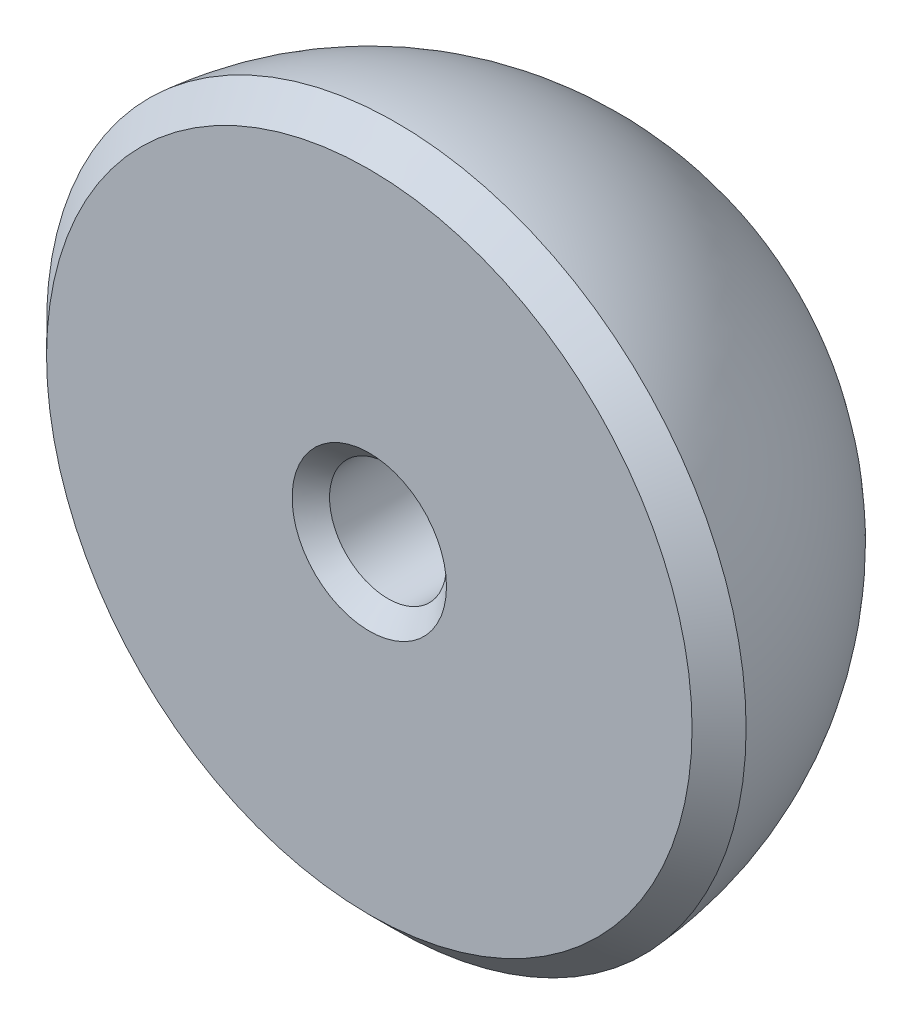
ISO-10303-21;
HEADER;
FILE_DESCRIPTION(('STEP AP214'),'2;1');
FILE_NAME('part.step','',(''),(''),'','','');
FILE_SCHEMA(('AUTOMOTIVE_DESIGN { 1 0 10303 214 1 1 1 1 }'));
ENDSEC;
DATA;
#1=APPLICATION_CONTEXT('core data for automotive mechanical design processes');
#2=APPLICATION_PROTOCOL_DEFINITION('international standard','automotive_design',2000,#1);
#3=PRODUCT_CONTEXT('',#1,'mechanical');
#4=PRODUCT('Part','Part','',(#3));
#5=PRODUCT_RELATED_PRODUCT_CATEGORY('part','',(#4));
#6=PRODUCT_DEFINITION_FORMATION('','',#4);
#7=PRODUCT_DEFINITION_CONTEXT('part definition',#1,'design');
#8=PRODUCT_DEFINITION('design','',#6,#7);
#9=PRODUCT_DEFINITION_SHAPE('','',#8);
#10=(LENGTH_UNIT() NAMED_UNIT(*) SI_UNIT(.MILLI.,.METRE.));
#11=(NAMED_UNIT(*) PLANE_ANGLE_UNIT() SI_UNIT($,.RADIAN.));
#12=(NAMED_UNIT(*) SI_UNIT($,.STERADIAN.) SOLID_ANGLE_UNIT());
#13=UNCERTAINTY_MEASURE_WITH_UNIT(LENGTH_MEASURE(1.E-05),#10,'distance_accuracy_value','');
#14=(GEOMETRIC_REPRESENTATION_CONTEXT(3) GLOBAL_UNCERTAINTY_ASSIGNED_CONTEXT((#13)) GLOBAL_UNIT_ASSIGNED_CONTEXT((#10,
#11,#12)) REPRESENTATION_CONTEXT('',''));
#15=CARTESIAN_POINT('',(0.,0.,0.));
#16=DIRECTION('',(0.,0.,1.));
#17=DIRECTION('',(1.,0.,0.));
#18=AXIS2_PLACEMENT_3D('',#15,#16,#17);
#19=CARTESIAN_POINT('',(0.,0.,0.));
#20=DIRECTION('',(0.,0.,1.));
#21=DIRECTION('',(1.,0.,0.));
#22=AXIS2_PLACEMENT_3D('',#19,#20,#21);
#23=CYLINDRICAL_SURFACE('',#22,1.5875);
#24=CARTESIAN_POINT('',(0.,0.,-2.67384938789308));
#25=DIRECTION('',(0.,0.,1.));
#26=DIRECTION('',(1.,0.,0.));
#27=AXIS2_PLACEMENT_3D('',#24,#25,#26);
#28=CIRCLE('',#27,1.5875);
#29=CARTESIAN_POINT('',(1.5875,0.,-2.67384938789308));
#30=VERTEX_POINT('',#29);
#31=EDGE_CURVE('E53',#30,#30,#28,.F.);
#32=ORIENTED_EDGE('',*,*,#31,.T.);
#33=EDGE_LOOP('',(#32));
#34=FACE_BOUND('',#33,.T.);
#35=CARTESIAN_POINT('',(0.,0.,-0.508000000000002));
#36=DIRECTION('',(0.,0.,1.));
#37=DIRECTION('',(1.,0.,0.));
#38=AXIS2_PLACEMENT_3D('',#35,#36,#37);
#39=CIRCLE('',#38,1.5875);
#40=CARTESIAN_POINT('',(1.5875,0.,-0.508000000000002));
#41=VERTEX_POINT('',#40);
#42=EDGE_CURVE('E56',#41,#41,#39,.T.);
#43=ORIENTED_EDGE('',*,*,#42,.T.);
#44=EDGE_LOOP('',(#43));
#45=FACE_BOUND('',#44,.T.);
#46=ADVANCED_FACE('F32',(#34,#45),#23,.F.);
#47=CARTESIAN_POINT('',(1.5875,0.,0.));
#48=DIRECTION('',(0.,0.,1.));
#49=DIRECTION('',(1.,0.,0.));
#50=AXIS2_PLACEMENT_3D('',#47,#48,#49);
#51=PLANE('',#50);
#52=CARTESIAN_POINT('',(0.,0.,0.));
#53=DIRECTION('',(0.,0.,1.));
#54=DIRECTION('',(1.,0.,0.));
#55=AXIS2_PLACEMENT_3D('',#52,#53,#54);
#56=CIRCLE('',#55,2.0955);
#57=CARTESIAN_POINT('',(2.0955,0.,0.));
#58=VERTEX_POINT('',#57);
#59=EDGE_CURVE('E44',#58,#58,#56,.F.);
#60=ORIENTED_EDGE('',*,*,#59,.T.);
#61=EDGE_LOOP('',(#60));
#62=FACE_BOUND('',#61,.T.);
#63=CARTESIAN_POINT('',(0.,0.,0.));
#64=DIRECTION('',(0.,0.,1.));
#65=DIRECTION('',(1.,0.,0.));
#66=AXIS2_PLACEMENT_3D('',#63,#64,#65);
#67=CIRCLE('',#66,8.76300000000001);
#68=CARTESIAN_POINT('',(8.76300000000001,0.,0.));
#69=VERTEX_POINT('',#68);
#70=EDGE_CURVE('E62',#69,#69,#67,.T.);
#71=ORIENTED_EDGE('',*,*,#70,.T.);
#72=EDGE_LOOP('',(#71));
#73=FACE_BOUND('',#72,.T.);
#74=ADVANCED_FACE('F87',(#62,#73),#51,.T.);
#75=CARTESIAN_POINT('',(0.,0.,0.));
#76=DIRECTION('',(0.,0.,1.));
#77=DIRECTION('',(1.,0.,0.));
#78=AXIS2_PLACEMENT_3D('',#75,#76,#77);
#79=SPHERICAL_SURFACE('',#78,9.525);
#80=CARTESIAN_POINT('',(0.,0.,-9.08629253509194));
#81=DIRECTION('',(0.,0.,1.));
#82=DIRECTION('',(1.,0.,0.));
#83=AXIS2_PLACEMENT_3D('',#80,#81,#82);
#84=CIRCLE('',#83,2.85743118320155);
#85=CARTESIAN_POINT('',(2.85743118320154,0.,-9.08629253509194));
#86=VERTEX_POINT('',#85);
#87=EDGE_CURVE('E10',#86,#86,#84,.T.);
#88=CARTESIAN_POINT('',(0.,0.,-0.733699922779166));
#89=DIRECTION('',(0.,0.,1.));
#90=DIRECTION('',(1.,0.,0.));
#91=AXIS2_PLACEMENT_3D('',#88,#89,#90);
#92=CIRCLE('',#91,9.49669992277917);
#93=CARTESIAN_POINT('',(9.49669992277917,0.,-0.733699922779166));
#94=VERTEX_POINT('',#93);
#95=EDGE_CURVE('E59',#94,#94,#92,.F.);
#96=CARTESIAN_POINT('',(2.85743118320154,0.,-9.08629253509194));
#97=CARTESIAN_POINT('',(2.96996963361237,0.,-9.05090290470426));
#98=CARTESIAN_POINT('',(3.08184988212297,0.,-9.01342050333686));
#99=CARTESIAN_POINT('',(3.30414113074718,0.,-8.93432639658185));
#100=CARTESIAN_POINT('',(3.41455213086079,0.,-8.89271469119425));
#101=CARTESIAN_POINT('',(3.63375203809447,0.,-8.80541821433812));
#102=CARTESIAN_POINT('',(3.74254094521454,0.,-8.75973344286959));
#103=CARTESIAN_POINT('',(3.95834660452778,0.,-8.66435422180381));
#104=CARTESIAN_POINT('',(4.06536335672094,0.,-8.61465977220656));
#105=CARTESIAN_POINT('',(4.27747694498504,0.,-8.51132970870316));
#106=CARTESIAN_POINT('',(4.38257378105598,0.,-8.45769409479702));
#107=CARTESIAN_POINT('',(4.59070246523173,0.,-8.34655576670554));
#108=CARTESIAN_POINT('',(4.69373431333655,0.,-8.28905305252021));
#109=CARTESIAN_POINT('',(4.89759078987735,0.,-8.17025989682426));
#110=CARTESIAN_POINT('',(4.99841541831334,0.,-8.10896945531364));
#111=CARTESIAN_POINT('',(5.197718273554,0.,-7.98268545453226));
#112=CARTESIAN_POINT('',(5.29619650035867,0.,-7.91769189526151));
#113=CARTESIAN_POINT('',(5.49067060869496,0.,-7.7840913783548));
#114=CARTESIAN_POINT('',(5.58666649022659,0.,-7.71548442071884));
#115=CARTESIAN_POINT('',(5.77604339130998,0.,-7.57475181512889));
#116=CARTESIAN_POINT('',(5.86942441086173,0.,-7.50262616717489));
#117=CARTESIAN_POINT('',(6.05344268089001,0.,-7.35495574619255));
#118=CARTESIAN_POINT('',(6.14407993136653,0.,-7.27941097316421));
#119=CARTESIAN_POINT('',(6.32248554377757,0.,-7.1250065872214));
#120=CARTESIAN_POINT('',(6.41025390571209,0.,-7.04614697430693));
#121=CARTESIAN_POINT('',(6.5828005819028,0.,-6.88522176971354));
#122=CARTESIAN_POINT('',(6.66757889615899,0.,-6.8031561780346));
#123=CARTESIAN_POINT('',(6.83402844544524,0.,-6.63593230270466));
#124=CARTESIAN_POINT('',(6.91569968047529,0.,-6.55077401905364));
#125=CARTESIAN_POINT('',(7.07582232890393,0.,-6.37748231585312));
#126=CARTESIAN_POINT('',(7.15427374230251,0.,-6.2893488963036));
#127=CARTESIAN_POINT('',(7.30784844984003,0.,-6.11022858438251));
#128=CARTESIAN_POINT('',(7.38297174397897,0.,-6.01924169201093));
#129=CARTESIAN_POINT('',(7.52978650964473,0.,-5.83454003657587));
#130=CARTESIAN_POINT('',(7.60147798117155,0.,-5.74082527351239));
#131=CARTESIAN_POINT('',(7.74133013569275,0.,-5.55079724449108));
#132=CARTESIAN_POINT('',(7.80949081868714,0.,-5.45448397853325));
#133=CARTESIAN_POINT('',(7.94218730427201,0.,-5.25939189860338));
#134=CARTESIAN_POINT('',(8.00672310686249,0.,-5.16061308463133));
#135=CARTESIAN_POINT('',(8.13208074370553,0.,-4.96072626709929));
#136=CARTESIAN_POINT('',(8.19290257795809,0.,-4.85961826353929));
#137=CARTESIAN_POINT('',(8.31074831710846,0.,-4.65521264056871));
#138=CARTESIAN_POINT('',(8.36777222200627,0.,-4.55191502115812));
#139=CARTESIAN_POINT('',(8.47794338425464,0.,-4.34327276286183));
#140=CARTESIAN_POINT('',(8.5310906416052,0.,-4.23792812397612));
#141=CARTESIAN_POINT('',(8.63343514204236,0.,-4.02533724889543));
#142=CARTESIAN_POINT('',(8.68263238512895,0.,-3.91809101270046));
#143=CARTESIAN_POINT('',(8.7770089431299,0.,-3.70184499021686));
#144=CARTESIAN_POINT('',(8.82218825804426,0.,-3.59284520392824));
#145=CARTESIAN_POINT('',(8.90846659214972,0.,-3.37324254912889));
#146=CARTESIAN_POINT('',(8.94956561134081,0.,-3.26263968061816));
#147=CARTESIAN_POINT('',(9.02762661965644,0.,-3.0399835422766));
#148=CARTESIAN_POINT('',(9.06458860878098,0.,-2.92793027244577));
#149=CARTESIAN_POINT('',(9.13432453132582,0.,-2.70252801430567));
#150=CARTESIAN_POINT('',(9.16709846474611,0.,-2.5891790259964));
#151=CARTESIAN_POINT('',(9.22841303991521,0.,-2.3613418033581));
#152=CARTESIAN_POINT('',(9.25695368166401,0.,-2.24685356902908));
#153=CARTESIAN_POINT('',(9.30976225035181,0.,-2.01689589591719));
#154=CARTESIAN_POINT('',(9.33403017729082,0.,-1.90142645713433));
#155=CARTESIAN_POINT('',(9.37825990709266,0.,-1.6696657844472));
#156=CARTESIAN_POINT('',(9.3982217099555,0.,-1.55337455054293));
#157=CARTESIAN_POINT('',(9.43381129513072,0.,-1.32013078185917));
#158=CARTESIAN_POINT('',(9.4494390774431,0.,-1.20317824707968));
#159=CARTESIAN_POINT('',(9.4763403185207,0.,-0.968773468615657));
#160=CARTESIAN_POINT('',(9.48761377728591,0.,-0.851321224931125));
#161=CARTESIAN_POINT('',(9.49669992277917,0.,-0.733699922779166));
#162=B_SPLINE_CURVE_WITH_KNOTS('',3,(#96,#97,#98,#99,#100,#101,#102,#103,#104,#105,#106,#107,
#108,#109,#110,#111,#112,#113,#114,#115,#116,#117,#118,#119,#120,#121,#122,#123,#124,#125,#126,
#127,#128,#129,#130,#131,#132,#133,#134,#135,#136,#137,#138,#139,#140,#141,#142,#143,#144,#145,
#146,#147,#148,#149,#150,#151,#152,#153,#154,#155,#156,#157,#158,#159,#160,#161),.UNSPECIFIED.,
.F.,.F.,(4,2,2,2,2,2,2,2,2,2,2,2,2,2,2,2,2,2,2,2,2,2,2,2,2,2,2,2,2,2,2,2,4),(0.,
0.353894709948073,0.707789419896144,1.06168412984422,1.41557883979229,1.76947354974036,
2.12336825968843,2.47726296963651,2.83115767958458,3.18505238953265,3.53894709948072,
3.89284180942879,4.24673651937687,4.60063122932494,4.95452593927301,5.30842064922108,
5.66231535916915,6.01621006911722,6.3701047790653,6.72399948901337,7.07789419896144,
7.43178890890951,7.78568361885758,8.13957832880566,8.49347303875373,8.8473677487018,
9.20126245864987,9.55515716859795,9.90905187854602,10.2629465884941,10.6168412984422,
10.9707360083902,11.3246307183383),.UNSPECIFIED.);
#163=EDGE_CURVE('BSEAM83',#86,#94,#162,.T.);
#164=ORIENTED_EDGE('',*,*,#87,.T.);
#165=ORIENTED_EDGE('',*,*,#95,.T.);
#166=ORIENTED_EDGE('',*,*,#163,.T.);
#167=ORIENTED_EDGE('',*,*,#163,.F.);
#168=EDGE_LOOP('',(#164,#166,#165,#167));
#169=FACE_BOUND('',#168,.T.);
#170=ADVANCED_FACE('F83',(#169),#79,.T.);
#171=CARTESIAN_POINT('',(0.,0.,-3.175));
#172=DIRECTION('',(0.,0.,-1.));
#173=DIRECTION('',(-1.,0.,0.));
#174=AXIS2_PLACEMENT_3D('',#171,#172,#173);
#175=CYLINDRICAL_SURFACE('',#174,2.38125);
#176=CARTESIAN_POINT('',(0.,0.,-8.80554858176401));
#177=DIRECTION('',(0.,0.,-1.));
#178=DIRECTION('',(-1.,0.,0.));
#179=AXIS2_PLACEMENT_3D('',#176,#177,#178);
#180=CIRCLE('',#179,2.38125);
#181=CARTESIAN_POINT('',(-2.38125,0.,-8.80554858176401));
#182=VERTEX_POINT('',#181);
#183=EDGE_CURVE('E40',#182,#182,#180,.T.);
#184=ORIENTED_EDGE('',*,*,#183,.T.);
#185=EDGE_LOOP('',(#184));
#186=FACE_BOUND('',#185,.T.);
#187=CARTESIAN_POINT('',(0.,0.,-3.571875));
#188=DIRECTION('',(0.,0.,-1.));
#189=DIRECTION('',(-1.,0.,0.));
#190=AXIS2_PLACEMENT_3D('',#187,#188,#189);
#191=CIRCLE('',#190,2.38125);
#192=CARTESIAN_POINT('',(-2.38125,0.,-3.571875));
#193=VERTEX_POINT('',#192);
#194=EDGE_CURVE('E65',#193,#193,#191,.F.);
#195=ORIENTED_EDGE('',*,*,#194,.T.);
#196=EDGE_LOOP('',(#195));
#197=FACE_BOUND('',#196,.T.);
#198=ADVANCED_FACE('F69',(#186,#197),#175,.F.);
#199=CARTESIAN_POINT('',(0.,0.,-3.571875));
#200=DIRECTION('',(0.,0.,-1.));
#201=DIRECTION('',(-1.,0.,0.));
#202=AXIS2_PLACEMENT_3D('',#199,#200,#201);
#203=TOROIDAL_SURFACE('',#202,1.984375,0.396875);
#204=CARTESIAN_POINT('',(0.,0.,-3.17800411749696));
#205=DIRECTION('',(0.,0.,-1.));
#206=DIRECTION('',(-1.,0.,0.));
#207=AXIS2_PLACEMENT_3D('',#204,#205,#206);
#208=CIRCLE('',#207,2.03311403508772);
#209=CARTESIAN_POINT('',(-2.03311403508772,0.,-3.17800411749696));
#210=VERTEX_POINT('',#209);
#211=EDGE_CURVE('E48',#210,#210,#208,.F.);
#212=ORIENTED_EDGE('',*,*,#211,.T.);
#213=EDGE_LOOP('',(#212));
#214=FACE_BOUND('',#213,.T.);
#215=ORIENTED_EDGE('',*,*,#194,.F.);
#216=EDGE_LOOP('',(#215));
#217=FACE_BOUND('',#216,.T.);
#218=ADVANCED_FACE('F71',(#214,#217),#203,.F.);
#219=CARTESIAN_POINT('',(0.,0.,0.));
#220=DIRECTION('',(0.,0.,-1.));
#221=DIRECTION('',(-1.,0.,0.));
#222=AXIS2_PLACEMENT_3D('',#219,#220,#221);
#223=CONICAL_SURFACE('',#222,8.76300000000001,0.785398163397444);
#224=ORIENTED_EDGE('',*,*,#95,.F.);
#225=EDGE_LOOP('',(#224));
#226=FACE_BOUND('',#225,.T.);
#227=ORIENTED_EDGE('',*,*,#70,.F.);
#228=EDGE_LOOP('',(#227));
#229=FACE_BOUND('',#228,.T.);
#230=ADVANCED_FACE('F73',(#226,#229),#223,.T.);
#231=CARTESIAN_POINT('',(0.,0.,-2.67384938789308));
#232=DIRECTION('',(0.,0.,-1.));
#233=DIRECTION('',(-1.,0.,0.));
#234=AXIS2_PLACEMENT_3D('',#231,#232,#233);
#235=CONICAL_SURFACE('',#234,1.5875,0.723839254154323);
#236=ORIENTED_EDGE('',*,*,#211,.F.);
#237=EDGE_LOOP('',(#236));
#238=FACE_BOUND('',#237,.T.);
#239=ORIENTED_EDGE('',*,*,#31,.F.);
#240=EDGE_LOOP('',(#239));
#241=FACE_BOUND('',#240,.T.);
#242=ADVANCED_FACE('F80',(#238,#241),#235,.F.);
#243=CARTESIAN_POINT('',(0.,0.,-0.508000000000002));
#244=DIRECTION('',(0.,0.,1.));
#245=DIRECTION('',(1.,0.,0.));
#246=AXIS2_PLACEMENT_3D('',#243,#244,#245);
#247=CONICAL_SURFACE('',#246,1.5875,0.78539816339745);
#248=ORIENTED_EDGE('',*,*,#59,.F.);
#249=EDGE_LOOP('',(#248));
#250=FACE_BOUND('',#249,.T.);
#251=ORIENTED_EDGE('',*,*,#42,.F.);
#252=EDGE_LOOP('',(#251));
#253=FACE_BOUND('',#252,.T.);
#254=ADVANCED_FACE('F125',(#250,#253),#247,.F.);
#255=CARTESIAN_POINT('',(0.,0.,-8.80554858176401));
#256=DIRECTION('',(0.,0.,-1.));
#257=DIRECTION('',(-1.,0.,0.));
#258=AXIS2_PLACEMENT_3D('',#255,#256,#257);
#259=CONICAL_SURFACE('',#258,2.38125,1.03807841853953);
#260=ORIENTED_EDGE('',*,*,#87,.F.);
#261=EDGE_LOOP('',(#260));
#262=FACE_BOUND('',#261,.T.);
#263=ORIENTED_EDGE('',*,*,#183,.F.);
#264=EDGE_LOOP('',(#263));
#265=FACE_BOUND('',#264,.T.);
#266=ADVANCED_FACE('F35',(#262,#265),#259,.F.);
#267=CLOSED_SHELL('',(#46,#74,#170,#198,#218,#230,#242,#254,#266));
#268=MANIFOLD_SOLID_BREP('B2',#267);
#269=ADVANCED_BREP_SHAPE_REPRESENTATION('',(#18,#268),#14);
#270=SHAPE_DEFINITION_REPRESENTATION(#9,#269);
ENDSEC;
END-ISO-10303-21;
